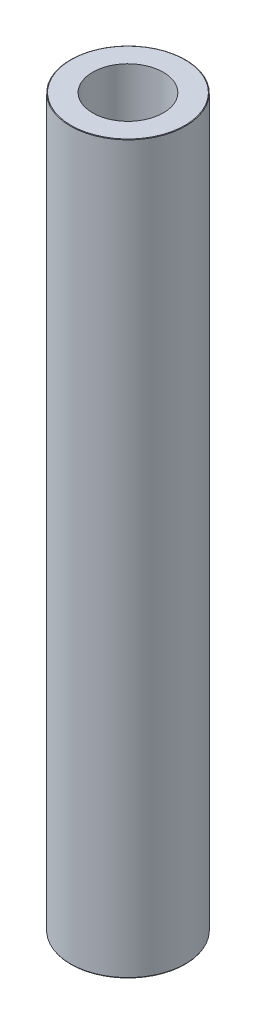
ISO-10303-21;
HEADER;
FILE_DESCRIPTION(('STEP AP214'),'2;1');
FILE_NAME('part.step','',(''),(''),'','','');
FILE_SCHEMA(('AUTOMOTIVE_DESIGN { 1 0 10303 214 1 1 1 1 }'));
ENDSEC;
DATA;
#1=APPLICATION_CONTEXT('core data for automotive mechanical design processes');
#2=APPLICATION_PROTOCOL_DEFINITION('international standard','automotive_design',2000,#1);
#3=PRODUCT_CONTEXT('',#1,'mechanical');
#4=PRODUCT('Part','Part','',(#3));
#5=PRODUCT_RELATED_PRODUCT_CATEGORY('part','',(#4));
#6=PRODUCT_DEFINITION_FORMATION('','',#4);
#7=PRODUCT_DEFINITION_CONTEXT('part definition',#1,'design');
#8=PRODUCT_DEFINITION('design','',#6,#7);
#9=PRODUCT_DEFINITION_SHAPE('','',#8);
#10=(LENGTH_UNIT() NAMED_UNIT(*) SI_UNIT(.MILLI.,.METRE.));
#11=(NAMED_UNIT(*) PLANE_ANGLE_UNIT() SI_UNIT($,.RADIAN.));
#12=(NAMED_UNIT(*) SI_UNIT($,.STERADIAN.) SOLID_ANGLE_UNIT());
#13=UNCERTAINTY_MEASURE_WITH_UNIT(LENGTH_MEASURE(1.E-05),#10,'distance_accuracy_value','');
#14=(GEOMETRIC_REPRESENTATION_CONTEXT(3) GLOBAL_UNCERTAINTY_ASSIGNED_CONTEXT((#13)) GLOBAL_UNIT_ASSIGNED_CONTEXT((#10,
#11,#12)) REPRESENTATION_CONTEXT('',''));
#15=CARTESIAN_POINT('',(0.,0.,0.));
#16=DIRECTION('',(0.,0.,1.));
#17=DIRECTION('',(1.,0.,0.));
#18=AXIS2_PLACEMENT_3D('',#15,#16,#17);
#19=CARTESIAN_POINT('',(0.,600.,0.));
#20=DIRECTION('',(0.,-1.,0.));
#21=DIRECTION('',(0.,0.,-1.));
#22=AXIS2_PLACEMENT_3D('',#19,#20,#21);
#23=CYLINDRICAL_SURFACE('',#22,47.5);
#24=CARTESIAN_POINT('',(0.,599.713588352018,0.));
#25=DIRECTION('',(0.,1.,0.));
#26=DIRECTION('',(0.,0.,1.));
#27=AXIS2_PLACEMENT_3D('',#24,#25,#26);
#28=CIRCLE('',#27,47.5);
#29=CARTESIAN_POINT('',(0.,599.713588352018,47.5));
#30=VERTEX_POINT('',#29);
#31=EDGE_CURVE('E50',#30,#30,#28,.F.);
#32=ORIENTED_EDGE('',*,*,#31,.T.);
#33=EDGE_LOOP('',(#32));
#34=FACE_BOUND('',#33,.T.);
#35=CARTESIAN_POINT('',(0.,0.50894441151339,0.));
#36=DIRECTION('',(0.,1.,0.));
#37=DIRECTION('',(0.,0.,1.));
#38=AXIS2_PLACEMENT_3D('',#35,#36,#37);
#39=CIRCLE('',#38,47.5);
#40=CARTESIAN_POINT('',(0.,0.50894441151339,47.5));
#41=VERTEX_POINT('',#40);
#42=EDGE_CURVE('E51',#41,#41,#39,.T.);
#43=ORIENTED_EDGE('',*,*,#42,.T.);
#44=EDGE_LOOP('',(#43));
#45=FACE_BOUND('',#44,.T.);
#46=ADVANCED_FACE('F39',(#34,#45),#23,.T.);
#47=CARTESIAN_POINT('',(0.,600.,0.));
#48=DIRECTION('',(0.,1.,0.));
#49=DIRECTION('',(0.,0.,1.));
#50=AXIS2_PLACEMENT_3D('',#47,#48,#49);
#51=PLANE('',#50);
#52=CARTESIAN_POINT('',(0.,600.,0.));
#53=DIRECTION('',(0.,1.,0.));
#54=DIRECTION('',(0.,0.,1.));
#55=AXIS2_PLACEMENT_3D('',#52,#53,#54);
#56=CIRCLE('',#55,46.9910555884867);
#57=CARTESIAN_POINT('',(0.,600.,46.9910555884867));
#58=VERTEX_POINT('',#57);
#59=EDGE_CURVE('E54',#58,#58,#56,.T.);
#60=ORIENTED_EDGE('',*,*,#59,.T.);
#61=EDGE_LOOP('',(#60));
#62=FACE_BOUND('',#61,.T.);
#63=CARTESIAN_POINT('',(0.,600.,0.));
#64=DIRECTION('',(0.,1.,0.));
#65=DIRECTION('',(0.,0.,1.));
#66=AXIS2_PLACEMENT_3D('',#63,#64,#65);
#67=CIRCLE('',#66,29.1577270973458);
#68=CARTESIAN_POINT('',(0.,600.,29.1577270973458));
#69=VERTEX_POINT('',#68);
#70=EDGE_CURVE('E58',#69,#69,#67,.T.);
#71=ORIENTED_EDGE('',*,*,#70,.F.);
#72=EDGE_LOOP('',(#71));
#73=FACE_BOUND('',#72,.T.);
#74=ADVANCED_FACE('F69',(#62,#73),#51,.T.);
#75=CARTESIAN_POINT('',(0.,0.,0.));
#76=DIRECTION('',(0.,1.,0.));
#77=DIRECTION('',(0.,0.,1.));
#78=AXIS2_PLACEMENT_3D('',#75,#76,#77);
#79=PLANE('',#78);
#80=CARTESIAN_POINT('',(0.,0.,0.));
#81=DIRECTION('',(0.,1.,0.));
#82=DIRECTION('',(0.,0.,1.));
#83=AXIS2_PLACEMENT_3D('',#80,#81,#82);
#84=CIRCLE('',#83,47.2135883520179);
#85=CARTESIAN_POINT('',(0.,0.,47.2135883520179));
#86=VERTEX_POINT('',#85);
#87=EDGE_CURVE('E10',#86,#86,#84,.F.);
#88=ORIENTED_EDGE('',*,*,#87,.T.);
#89=EDGE_LOOP('',(#88));
#90=FACE_BOUND('',#89,.T.);
#91=CARTESIAN_POINT('',(0.,0.,0.));
#92=DIRECTION('',(0.,1.,0.));
#93=DIRECTION('',(0.,0.,1.));
#94=AXIS2_PLACEMENT_3D('',#91,#92,#93);
#95=CIRCLE('',#94,29.1577270973458);
#96=CARTESIAN_POINT('',(0.,0.,29.1577270973458));
#97=VERTEX_POINT('',#96);
#98=EDGE_CURVE('E63',#97,#97,#95,.T.);
#99=ORIENTED_EDGE('',*,*,#98,.T.);
#100=EDGE_LOOP('',(#99));
#101=FACE_BOUND('',#100,.T.);
#102=ADVANCED_FACE('F75',(#90,#101),#79,.F.);
#103=CARTESIAN_POINT('',(0.,600.,0.));
#104=DIRECTION('',(0.,-1.,0.));
#105=DIRECTION('',(0.,0.,-1.));
#106=AXIS2_PLACEMENT_3D('',#103,#104,#105);
#107=CYLINDRICAL_SURFACE('',#106,29.1577270973458);
#108=ORIENTED_EDGE('',*,*,#70,.T.);
#109=EDGE_LOOP('',(#108));
#110=FACE_BOUND('',#109,.T.);
#111=ORIENTED_EDGE('',*,*,#98,.F.);
#112=EDGE_LOOP('',(#111));
#113=FACE_BOUND('',#112,.T.);
#114=ADVANCED_FACE('F70',(#110,#113),#107,.F.);
#115=CARTESIAN_POINT('',(0.,600.,0.));
#116=DIRECTION('',(0.,-1.,0.));
#117=DIRECTION('',(0.,0.,-1.));
#118=AXIS2_PLACEMENT_3D('',#115,#116,#117);
#119=CONICAL_SURFACE('',#118,46.9910555884867,1.05821222979043);
#120=ORIENTED_EDGE('',*,*,#31,.F.);
#121=EDGE_LOOP('',(#120));
#122=FACE_BOUND('',#121,.T.);
#123=ORIENTED_EDGE('',*,*,#59,.F.);
#124=EDGE_LOOP('',(#123));
#125=FACE_BOUND('',#124,.T.);
#126=ADVANCED_FACE('F81',(#122,#125),#119,.T.);
#127=CARTESIAN_POINT('',(0.,0.50894441151339,0.));
#128=DIRECTION('',(0.,1.,0.));
#129=DIRECTION('',(0.,0.,1.));
#130=AXIS2_PLACEMENT_3D('',#127,#128,#129);
#131=CONICAL_SURFACE('',#130,47.5,0.512584097004503);
#132=ORIENTED_EDGE('',*,*,#87,.F.);
#133=EDGE_LOOP('',(#132));
#134=FACE_BOUND('',#133,.T.);
#135=ORIENTED_EDGE('',*,*,#42,.F.);
#136=EDGE_LOOP('',(#135));
#137=FACE_BOUND('',#136,.T.);
#138=ADVANCED_FACE('F45',(#134,#137),#131,.T.);
#139=CLOSED_SHELL('',(#46,#74,#102,#114,#126,#138));
#140=MANIFOLD_SOLID_BREP('B2',#139);
#141=ADVANCED_BREP_SHAPE_REPRESENTATION('',(#18,#140),#14);
#142=SHAPE_DEFINITION_REPRESENTATION(#9,#141);
ENDSEC;
END-ISO-10303-21;
